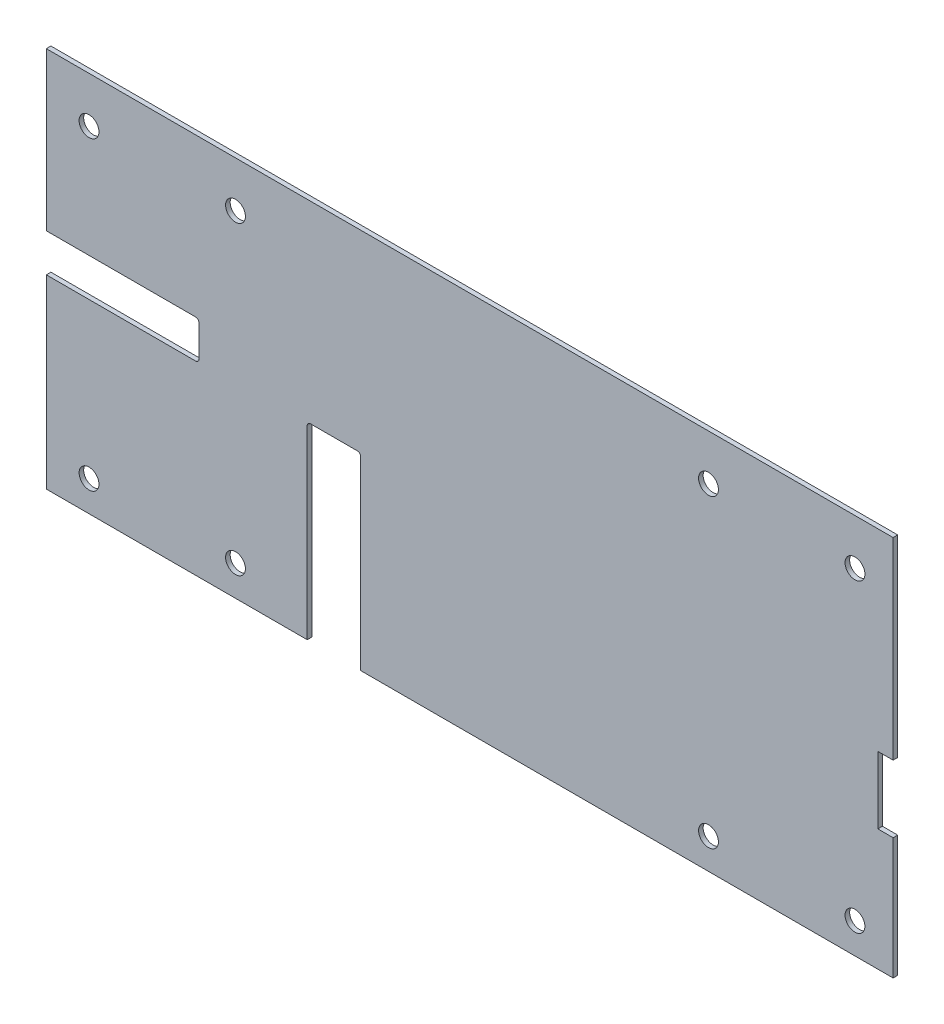
ISO-10303-21;
HEADER;
FILE_DESCRIPTION(('STEP AP214'),'2;1');
FILE_NAME('part.step','',(''),(''),'','','');
FILE_SCHEMA(('AUTOMOTIVE_DESIGN { 1 0 10303 214 1 1 1 1 }'));
ENDSEC;
DATA;
#1=APPLICATION_CONTEXT('core data for automotive mechanical design processes');
#2=APPLICATION_PROTOCOL_DEFINITION('international standard','automotive_design',2000,#1);
#3=PRODUCT_CONTEXT('',#1,'mechanical');
#4=PRODUCT('Part','Part','',(#3));
#5=PRODUCT_RELATED_PRODUCT_CATEGORY('part','',(#4));
#6=PRODUCT_DEFINITION_FORMATION('','',#4);
#7=PRODUCT_DEFINITION_CONTEXT('part definition',#1,'design');
#8=PRODUCT_DEFINITION('design','',#6,#7);
#9=PRODUCT_DEFINITION_SHAPE('','',#8);
#10=(LENGTH_UNIT() NAMED_UNIT(*) SI_UNIT(.MILLI.,.METRE.));
#11=(NAMED_UNIT(*) PLANE_ANGLE_UNIT() SI_UNIT($,.RADIAN.));
#12=(NAMED_UNIT(*) SI_UNIT($,.STERADIAN.) SOLID_ANGLE_UNIT());
#13=UNCERTAINTY_MEASURE_WITH_UNIT(LENGTH_MEASURE(1.E-05),#10,'distance_accuracy_value','');
#14=(GEOMETRIC_REPRESENTATION_CONTEXT(3) GLOBAL_UNCERTAINTY_ASSIGNED_CONTEXT((#13)) GLOBAL_UNIT_ASSIGNED_CONTEXT((#10,
#11,#12)) REPRESENTATION_CONTEXT('',''));
#15=CARTESIAN_POINT('',(0.,0.,0.));
#16=DIRECTION('',(0.,0.,1.));
#17=DIRECTION('',(1.,0.,0.));
#18=AXIS2_PLACEMENT_3D('',#15,#16,#17);
#19=CARTESIAN_POINT('',(-277.5,-125.,3.));
#20=DIRECTION('',(1.,0.,0.));
#21=DIRECTION('',(0.,0.,-1.));
#22=AXIS2_PLACEMENT_3D('',#19,#20,#21);
#23=PLANE('',#22);
#24=DIRECTION('',(0.,-1.,0.));
#25=VECTOR('',#24,1.);
#26=CARTESIAN_POINT('',(-277.5,-125.,0.));
#27=LINE('',#26,#25);
#28=CARTESIAN_POINT('',(-277.5,125.,0.));
#29=VERTEX_POINT('',#28);
#30=CARTESIAN_POINT('',(-277.5,21.6289621839158,0.));
#31=VERTEX_POINT('',#30);
#32=EDGE_CURVE('E218',#29,#31,#27,.T.);
#33=ORIENTED_EDGE('',*,*,#32,.T.);
#34=DIRECTION('',(0.,0.,1.));
#35=VECTOR('',#34,1.);
#36=CARTESIAN_POINT('',(-277.5,21.6289621839158,3.));
#37=LINE('',#36,#35);
#38=CARTESIAN_POINT('',(-277.5,21.6289621839158,3.));
#39=VERTEX_POINT('',#38);
#40=EDGE_CURVE('E179',#31,#39,#37,.T.);
#41=ORIENTED_EDGE('',*,*,#40,.T.);
#42=DIRECTION('',(0.,-1.,0.));
#43=VECTOR('',#42,1.);
#44=CARTESIAN_POINT('',(-277.5,-125.,3.));
#45=LINE('',#44,#43);
#46=CARTESIAN_POINT('',(-277.5,125.,3.));
#47=VERTEX_POINT('',#46);
#48=EDGE_CURVE('E198',#47,#39,#45,.T.);
#49=ORIENTED_EDGE('',*,*,#48,.F.);
#50=DIRECTION('',(0.,0.,-1.));
#51=VECTOR('',#50,1.);
#52=CARTESIAN_POINT('',(-277.5,125.,3.));
#53=LINE('',#52,#51);
#54=EDGE_CURVE('E217',#47,#29,#53,.T.);
#55=ORIENTED_EDGE('',*,*,#54,.T.);
#56=EDGE_LOOP('',(#33,#41,#49,#55));
#57=FACE_BOUND('',#56,.T.);
#58=ADVANCED_FACE('F33',(#57),#23,.F.);
#59=CARTESIAN_POINT('',(277.5,-125.,3.));
#60=DIRECTION('',(0.,1.,0.));
#61=DIRECTION('',(-1.,0.,0.));
#62=AXIS2_PLACEMENT_3D('',#59,#60,#61);
#63=PLANE('',#62);
#64=DIRECTION('',(1.,0.,0.));
#65=VECTOR('',#64,1.);
#66=CARTESIAN_POINT('',(277.5,-125.,3.));
#67=LINE('',#66,#65);
#68=CARTESIAN_POINT('',(-71.5,-125.,3.));
#69=VERTEX_POINT('',#68);
#70=CARTESIAN_POINT('',(277.5,-125.,3.));
#71=VERTEX_POINT('',#70);
#72=EDGE_CURVE('E202',#69,#71,#67,.T.);
#73=ORIENTED_EDGE('',*,*,#72,.F.);
#74=DIRECTION('',(0.,0.,-1.));
#75=VECTOR('',#74,1.);
#76=CARTESIAN_POINT('',(-71.5,-125.,3.));
#77=LINE('',#76,#75);
#78=CARTESIAN_POINT('',(-71.5,-125.,0.));
#79=VERTEX_POINT('',#78);
#80=EDGE_CURVE('E180',#69,#79,#77,.T.);
#81=ORIENTED_EDGE('',*,*,#80,.T.);
#82=DIRECTION('',(1.,0.,0.));
#83=VECTOR('',#82,1.);
#84=CARTESIAN_POINT('',(277.5,-125.,0.));
#85=LINE('',#84,#83);
#86=CARTESIAN_POINT('',(277.5,-125.,0.));
#87=VERTEX_POINT('',#86);
#88=EDGE_CURVE('E221',#79,#87,#85,.T.);
#89=ORIENTED_EDGE('',*,*,#88,.T.);
#90=DIRECTION('',(0.,0.,-1.));
#91=VECTOR('',#90,1.);
#92=CARTESIAN_POINT('',(277.5,-125.,3.));
#93=LINE('',#92,#91);
#94=EDGE_CURVE('E234',#71,#87,#93,.T.);
#95=ORIENTED_EDGE('',*,*,#94,.F.);
#96=EDGE_LOOP('',(#73,#81,#89,#95));
#97=FACE_BOUND('',#96,.T.);
#98=ADVANCED_FACE('F373',(#97),#63,.F.);
#99=CARTESIAN_POINT('',(277.5,-125.,3.));
#100=DIRECTION('',(-1.,0.,0.));
#101=DIRECTION('',(0.,0.,1.));
#102=AXIS2_PLACEMENT_3D('',#99,#100,#101);
#103=PLANE('',#102);
#104=DIRECTION('',(0.,1.,0.));
#105=VECTOR('',#104,1.);
#106=CARTESIAN_POINT('',(277.5,-125.,0.));
#107=LINE('',#106,#105);
#108=CARTESIAN_POINT('',(277.5,-45.3710378160842,0.));
#109=VERTEX_POINT('',#108);
#110=EDGE_CURVE('E203',#87,#109,#107,.T.);
#111=ORIENTED_EDGE('',*,*,#110,.T.);
#112=DIRECTION('',(0.,0.,1.));
#113=VECTOR('',#112,1.);
#114=CARTESIAN_POINT('',(277.5,-45.3710378160842,3.));
#115=LINE('',#114,#113);
#116=CARTESIAN_POINT('',(277.5,-45.3710378160842,3.));
#117=VERTEX_POINT('',#116);
#118=EDGE_CURVE('E241',#109,#117,#115,.T.);
#119=ORIENTED_EDGE('',*,*,#118,.T.);
#120=DIRECTION('',(0.,1.,0.));
#121=VECTOR('',#120,1.);
#122=CARTESIAN_POINT('',(277.5,-125.,3.));
#123=LINE('',#122,#121);
#124=EDGE_CURVE('E212',#71,#117,#123,.T.);
#125=ORIENTED_EDGE('',*,*,#124,.F.);
#126=ORIENTED_EDGE('',*,*,#94,.T.);
#127=EDGE_LOOP('',(#111,#119,#125,#126));
#128=FACE_BOUND('',#127,.T.);
#129=ADVANCED_FACE('F379',(#128),#103,.F.);
#130=CARTESIAN_POINT('',(0.,0.,3.));
#131=DIRECTION('',(0.,0.,1.));
#132=DIRECTION('',(1.,0.,0.));
#133=AXIS2_PLACEMENT_3D('',#130,#131,#132);
#134=PLANE('',#133);
#135=DIRECTION('',(-1.,0.,0.));
#136=VECTOR('',#135,1.);
#137=CARTESIAN_POINT('',(-277.5,21.6289621839158,3.));
#138=LINE('',#137,#136);
#139=CARTESIAN_POINT('',(-179.5,21.6289621839158,3.));
#140=VERTEX_POINT('',#139);
#141=EDGE_CURVE('E289',#140,#39,#138,.T.);
#142=ORIENTED_EDGE('',*,*,#141,.F.);
#143=CARTESIAN_POINT('',(-179.5,19.6289621839158,3.));
#144=DIRECTION('',(0.,0.,1.));
#145=DIRECTION('',(1.,0.,0.));
#146=AXIS2_PLACEMENT_3D('',#143,#144,#145);
#147=CIRCLE('',#146,2.);
#148=CARTESIAN_POINT('',(-177.5,19.6289621839158,3.));
#149=VERTEX_POINT('',#148);
#150=EDGE_CURVE('E41',#140,#149,#147,.F.);
#151=ORIENTED_EDGE('',*,*,#150,.T.);
#152=DIRECTION('',(0.,1.,0.));
#153=VECTOR('',#152,1.);
#154=CARTESIAN_POINT('',(-177.5,-3.37103781608424,3.));
#155=LINE('',#154,#153);
#156=CARTESIAN_POINT('',(-177.5,-1.37103781608423,3.));
#157=VERTEX_POINT('',#156);
#158=EDGE_CURVE('E191',#157,#149,#155,.T.);
#159=ORIENTED_EDGE('',*,*,#158,.F.);
#160=CARTESIAN_POINT('',(-179.5,-1.37103781608423,3.));
#161=DIRECTION('',(0.,0.,1.));
#162=DIRECTION('',(1.,0.,0.));
#163=AXIS2_PLACEMENT_3D('',#160,#161,#162);
#164=CIRCLE('',#163,2.);
#165=CARTESIAN_POINT('',(-179.5,-3.37103781608423,3.));
#166=VERTEX_POINT('',#165);
#167=EDGE_CURVE('E190',#157,#166,#164,.F.);
#168=ORIENTED_EDGE('',*,*,#167,.T.);
#169=DIRECTION('',(1.,0.,0.));
#170=VECTOR('',#169,1.);
#171=CARTESIAN_POINT('',(-277.5,-3.37103781608422,3.));
#172=LINE('',#171,#170);
#173=CARTESIAN_POINT('',(-277.5,-3.37103781608422,3.));
#174=VERTEX_POINT('',#173);
#175=EDGE_CURVE('E172',#174,#166,#172,.T.);
#176=ORIENTED_EDGE('',*,*,#175,.F.);
#177=CARTESIAN_POINT('',(-277.5,-125.,3.));
#178=VERTEX_POINT('',#177);
#179=EDGE_CURVE('E187',#174,#178,#45,.T.);
#180=ORIENTED_EDGE('',*,*,#179,.T.);
#181=CARTESIAN_POINT('',(-106.5,-125.,3.));
#182=VERTEX_POINT('',#181);
#183=EDGE_CURVE('E209',#178,#182,#67,.T.);
#184=ORIENTED_EDGE('',*,*,#183,.T.);
#185=DIRECTION('',(0.,-1.,0.));
#186=VECTOR('',#185,1.);
#187=CARTESIAN_POINT('',(-106.5,-1.37103781608425,3.));
#188=LINE('',#187,#186);
#189=CARTESIAN_POINT('',(-106.5,-3.37103781608425,3.));
#190=VERTEX_POINT('',#189);
#191=EDGE_CURVE('E192',#190,#182,#188,.T.);
#192=ORIENTED_EDGE('',*,*,#191,.F.);
#193=CARTESIAN_POINT('',(-104.5,-3.37103781608425,3.));
#194=DIRECTION('',(0.,0.,1.));
#195=DIRECTION('',(1.,0.,0.));
#196=AXIS2_PLACEMENT_3D('',#193,#194,#195);
#197=CIRCLE('',#196,2.);
#198=CARTESIAN_POINT('',(-104.5,-1.37103781608425,3.));
#199=VERTEX_POINT('',#198);
#200=EDGE_CURVE('E282',#190,#199,#197,.F.);
#201=ORIENTED_EDGE('',*,*,#200,.T.);
#202=DIRECTION('',(-1.,0.,0.));
#203=VECTOR('',#202,1.);
#204=CARTESIAN_POINT('',(-71.5,-1.37103781608424,3.));
#205=LINE('',#204,#203);
#206=CARTESIAN_POINT('',(-73.5,-1.37103781608424,3.));
#207=VERTEX_POINT('',#206);
#208=EDGE_CURVE('E431',#207,#199,#205,.T.);
#209=ORIENTED_EDGE('',*,*,#208,.F.);
#210=CARTESIAN_POINT('',(-73.5,-3.37103781608424,3.));
#211=DIRECTION('',(0.,0.,1.));
#212=DIRECTION('',(1.,0.,0.));
#213=AXIS2_PLACEMENT_3D('',#210,#211,#212);
#214=CIRCLE('',#213,2.);
#215=CARTESIAN_POINT('',(-71.5,-3.37103781608424,3.));
#216=VERTEX_POINT('',#215);
#217=EDGE_CURVE('E278',#207,#216,#214,.F.);
#218=ORIENTED_EDGE('',*,*,#217,.T.);
#219=DIRECTION('',(0.,1.,0.));
#220=VECTOR('',#219,1.);
#221=CARTESIAN_POINT('',(-71.5,-1.37103781608424,3.));
#222=LINE('',#221,#220);
#223=EDGE_CURVE('E436',#69,#216,#222,.T.);
#224=ORIENTED_EDGE('',*,*,#223,.F.);
#225=ORIENTED_EDGE('',*,*,#72,.T.);
#226=ORIENTED_EDGE('',*,*,#124,.T.);
#227=DIRECTION('',(1.,0.,0.));
#228=VECTOR('',#227,1.);
#229=CARTESIAN_POINT('',(277.5,-45.3710378160842,3.));
#230=LINE('',#229,#228);
#231=CARTESIAN_POINT('',(267.5,-45.3710378160842,3.));
#232=VERTEX_POINT('',#231);
#233=EDGE_CURVE('E449',#232,#117,#230,.T.);
#234=ORIENTED_EDGE('',*,*,#233,.F.);
#235=DIRECTION('',(0.,-1.,0.));
#236=VECTOR('',#235,1.);
#237=CARTESIAN_POINT('',(267.5,-1.3710378160842,3.));
#238=LINE('',#237,#236);
#239=CARTESIAN_POINT('',(267.5,-1.3710378160842,3.));
#240=VERTEX_POINT('',#239);
#241=EDGE_CURVE('E446',#240,#232,#238,.T.);
#242=ORIENTED_EDGE('',*,*,#241,.F.);
#243=DIRECTION('',(-1.,0.,0.));
#244=VECTOR('',#243,1.);
#245=CARTESIAN_POINT('',(277.5,-1.37103781608421,3.));
#246=LINE('',#245,#244);
#247=CARTESIAN_POINT('',(277.5,-1.37103781608421,3.));
#248=VERTEX_POINT('',#247);
#249=EDGE_CURVE('E443',#248,#240,#246,.T.);
#250=ORIENTED_EDGE('',*,*,#249,.F.);
#251=CARTESIAN_POINT('',(277.5,125.,3.));
#252=VERTEX_POINT('',#251);
#253=EDGE_CURVE('E211',#248,#252,#123,.T.);
#254=ORIENTED_EDGE('',*,*,#253,.T.);
#255=DIRECTION('',(-1.,0.,0.));
#256=VECTOR('',#255,1.);
#257=CARTESIAN_POINT('',(277.5,125.,3.));
#258=LINE('',#257,#256);
#259=EDGE_CURVE('E215',#252,#47,#258,.T.);
#260=ORIENTED_EDGE('',*,*,#259,.T.);
#261=ORIENTED_EDGE('',*,*,#48,.T.);
#262=EDGE_LOOP('',(#142,#151,#159,#168,#176,#180,#184,#192,#201,#209,#218,#224,#225,#226,#234,
#242,#250,#254,#260,#261));
#263=FACE_BOUND('',#262,.T.);
#264=CARTESIAN_POINT('',(-249.5,95.,3.));
#265=DIRECTION('',(0.,0.,1.));
#266=DIRECTION('',(1.,0.,0.));
#267=AXIS2_PLACEMENT_3D('',#264,#265,#266);
#268=CIRCLE('',#267,6.50000000000002);
#269=CARTESIAN_POINT('',(-243.,95.,3.));
#270=VERTEX_POINT('',#269);
#271=EDGE_CURVE('E312',#270,#270,#268,.T.);
#272=ORIENTED_EDGE('',*,*,#271,.F.);
#273=EDGE_LOOP('',(#272));
#274=FACE_BOUND('',#273,.T.);
#275=CARTESIAN_POINT('',(-153.5,-105.,3.));
#276=DIRECTION('',(0.,0.,1.));
#277=DIRECTION('',(1.,0.,0.));
#278=AXIS2_PLACEMENT_3D('',#275,#276,#277);
#279=CIRCLE('',#278,6.50000000000002);
#280=CARTESIAN_POINT('',(-147.,-105.,3.));
#281=VERTEX_POINT('',#280);
#282=EDGE_CURVE('E324',#281,#281,#279,.T.);
#283=ORIENTED_EDGE('',*,*,#282,.F.);
#284=EDGE_LOOP('',(#283));
#285=FACE_BOUND('',#284,.T.);
#286=CARTESIAN_POINT('',(156.5,-105.,3.));
#287=DIRECTION('',(0.,0.,1.));
#288=DIRECTION('',(1.,0.,0.));
#289=AXIS2_PLACEMENT_3D('',#286,#287,#288);
#290=CIRCLE('',#289,6.50000000000002);
#291=CARTESIAN_POINT('',(163.,-105.,3.));
#292=VERTEX_POINT('',#291);
#293=EDGE_CURVE('E336',#292,#292,#290,.T.);
#294=ORIENTED_EDGE('',*,*,#293,.F.);
#295=EDGE_LOOP('',(#294));
#296=FACE_BOUND('',#295,.T.);
#297=CARTESIAN_POINT('',(156.5,95.,3.));
#298=DIRECTION('',(0.,0.,1.));
#299=DIRECTION('',(1.,0.,0.));
#300=AXIS2_PLACEMENT_3D('',#297,#298,#299);
#301=CIRCLE('',#300,6.50000000000002);
#302=CARTESIAN_POINT('',(163.,95.,3.));
#303=VERTEX_POINT('',#302);
#304=EDGE_CURVE('E346',#303,#303,#301,.T.);
#305=ORIENTED_EDGE('',*,*,#304,.F.);
#306=EDGE_LOOP('',(#305));
#307=FACE_BOUND('',#306,.T.);
#308=CARTESIAN_POINT('',(252.5,95.,3.));
#309=DIRECTION('',(0.,0.,1.));
#310=DIRECTION('',(1.,0.,0.));
#311=AXIS2_PLACEMENT_3D('',#308,#309,#310);
#312=CIRCLE('',#311,6.50000000000002);
#313=CARTESIAN_POINT('',(259.,95.,3.));
#314=VERTEX_POINT('',#313);
#315=EDGE_CURVE('E342',#314,#314,#312,.T.);
#316=ORIENTED_EDGE('',*,*,#315,.F.);
#317=EDGE_LOOP('',(#316));
#318=FACE_BOUND('',#317,.T.);
#319=CARTESIAN_POINT('',(252.5,-105.,3.));
#320=DIRECTION('',(0.,0.,1.));
#321=DIRECTION('',(1.,0.,0.));
#322=AXIS2_PLACEMENT_3D('',#319,#320,#321);
#323=CIRCLE('',#322,6.50000000000007);
#324=CARTESIAN_POINT('',(259.,-105.,3.));
#325=VERTEX_POINT('',#324);
#326=EDGE_CURVE('E330',#325,#325,#323,.T.);
#327=ORIENTED_EDGE('',*,*,#326,.F.);
#328=EDGE_LOOP('',(#327));
#329=FACE_BOUND('',#328,.T.);
#330=CARTESIAN_POINT('',(-153.5,95.,3.));
#331=DIRECTION('',(0.,0.,1.));
#332=DIRECTION('',(1.,0.,0.));
#333=AXIS2_PLACEMENT_3D('',#330,#331,#332);
#334=CIRCLE('',#333,6.50000000000002);
#335=CARTESIAN_POINT('',(-147.,95.,3.));
#336=VERTEX_POINT('',#335);
#337=EDGE_CURVE('E318',#336,#336,#334,.T.);
#338=ORIENTED_EDGE('',*,*,#337,.F.);
#339=EDGE_LOOP('',(#338));
#340=FACE_BOUND('',#339,.T.);
#341=CARTESIAN_POINT('',(-249.5,-105.,3.));
#342=DIRECTION('',(0.,0.,1.));
#343=DIRECTION('',(1.,0.,0.));
#344=AXIS2_PLACEMENT_3D('',#341,#342,#343);
#345=CIRCLE('',#344,6.50000000000002);
#346=CARTESIAN_POINT('',(-243.,-105.,3.));
#347=VERTEX_POINT('',#346);
#348=EDGE_CURVE('E303',#347,#347,#345,.T.);
#349=ORIENTED_EDGE('',*,*,#348,.F.);
#350=EDGE_LOOP('',(#349));
#351=FACE_BOUND('',#350,.T.);
#352=ADVANCED_FACE('F184',(#263,#274,#285,#296,#307,#318,#329,#340,#351),#134,.T.);
#353=CARTESIAN_POINT('',(0.,0.,0.));
#354=DIRECTION('',(0.,0.,1.));
#355=DIRECTION('',(1.,0.,0.));
#356=AXIS2_PLACEMENT_3D('',#353,#354,#355);
#357=PLANE('',#356);
#358=DIRECTION('',(1.,0.,0.));
#359=VECTOR('',#358,1.);
#360=CARTESIAN_POINT('',(0.,-3.37103781608426,0.));
#361=LINE('',#360,#359);
#362=CARTESIAN_POINT('',(-277.5,-3.37103781608422,0.));
#363=VERTEX_POINT('',#362);
#364=CARTESIAN_POINT('',(-179.5,-3.37103781608424,0.));
#365=VERTEX_POINT('',#364);
#366=EDGE_CURVE('E175',#363,#365,#361,.T.);
#367=ORIENTED_EDGE('',*,*,#366,.T.);
#368=CARTESIAN_POINT('',(-179.5,-1.37103781608423,0.));
#369=DIRECTION('',(0.,0.,1.));
#370=DIRECTION('',(1.,0.,0.));
#371=AXIS2_PLACEMENT_3D('',#368,#369,#370);
#372=CIRCLE('',#371,2.);
#373=CARTESIAN_POINT('',(-177.5,-1.37103781608423,0.));
#374=VERTEX_POINT('',#373);
#375=EDGE_CURVE('E287',#365,#374,#372,.T.);
#376=ORIENTED_EDGE('',*,*,#375,.T.);
#377=DIRECTION('',(0.,1.,0.));
#378=VECTOR('',#377,1.);
#379=CARTESIAN_POINT('',(-177.5,0.,0.));
#380=LINE('',#379,#378);
#381=CARTESIAN_POINT('',(-177.5,19.6289621839158,0.));
#382=VERTEX_POINT('',#381);
#383=EDGE_CURVE('E257',#374,#382,#380,.T.);
#384=ORIENTED_EDGE('',*,*,#383,.T.);
#385=CARTESIAN_POINT('',(-179.5,19.6289621839158,0.));
#386=DIRECTION('',(0.,0.,1.));
#387=DIRECTION('',(1.,0.,0.));
#388=AXIS2_PLACEMENT_3D('',#385,#386,#387);
#389=CIRCLE('',#388,2.);
#390=CARTESIAN_POINT('',(-179.5,21.6289621839158,0.));
#391=VERTEX_POINT('',#390);
#392=EDGE_CURVE('E11',#382,#391,#389,.T.);
#393=ORIENTED_EDGE('',*,*,#392,.T.);
#394=DIRECTION('',(-1.,0.,0.));
#395=VECTOR('',#394,1.);
#396=CARTESIAN_POINT('',(0.,21.6289621839158,0.));
#397=LINE('',#396,#395);
#398=EDGE_CURVE('E298',#391,#31,#397,.T.);
#399=ORIENTED_EDGE('',*,*,#398,.T.);
#400=ORIENTED_EDGE('',*,*,#32,.F.);
#401=DIRECTION('',(-1.,0.,0.));
#402=VECTOR('',#401,1.);
#403=CARTESIAN_POINT('',(277.5,125.,0.));
#404=LINE('',#403,#402);
#405=CARTESIAN_POINT('',(277.5,125.,0.));
#406=VERTEX_POINT('',#405);
#407=EDGE_CURVE('E199',#406,#29,#404,.T.);
#408=ORIENTED_EDGE('',*,*,#407,.F.);
#409=CARTESIAN_POINT('',(277.5,-1.37103781608421,0.));
#410=VERTEX_POINT('',#409);
#411=EDGE_CURVE('E226',#410,#406,#107,.T.);
#412=ORIENTED_EDGE('',*,*,#411,.F.);
#413=DIRECTION('',(-1.,0.,0.));
#414=VECTOR('',#413,1.);
#415=CARTESIAN_POINT('',(0.,-1.37103781608401,0.));
#416=LINE('',#415,#414);
#417=CARTESIAN_POINT('',(267.5,-1.3710378160842,0.));
#418=VERTEX_POINT('',#417);
#419=EDGE_CURVE('E415',#410,#418,#416,.T.);
#420=ORIENTED_EDGE('',*,*,#419,.T.);
#421=DIRECTION('',(0.,-1.,0.));
#422=VECTOR('',#421,1.);
#423=CARTESIAN_POINT('',(267.5,0.,0.));
#424=LINE('',#423,#422);
#425=CARTESIAN_POINT('',(267.5,-45.3710378160842,0.));
#426=VERTEX_POINT('',#425);
#427=EDGE_CURVE('E251',#418,#426,#424,.T.);
#428=ORIENTED_EDGE('',*,*,#427,.T.);
#429=DIRECTION('',(1.,0.,0.));
#430=VECTOR('',#429,1.);
#431=CARTESIAN_POINT('',(0.,-45.371037816084,0.));
#432=LINE('',#431,#430);
#433=EDGE_CURVE('E410',#426,#109,#432,.T.);
#434=ORIENTED_EDGE('',*,*,#433,.T.);
#435=ORIENTED_EDGE('',*,*,#110,.F.);
#436=ORIENTED_EDGE('',*,*,#88,.F.);
#437=DIRECTION('',(0.,1.,0.));
#438=VECTOR('',#437,1.);
#439=CARTESIAN_POINT('',(-71.5,0.,0.));
#440=LINE('',#439,#438);
#441=CARTESIAN_POINT('',(-71.5,-3.37103781608424,0.));
#442=VERTEX_POINT('',#441);
#443=EDGE_CURVE('E305',#79,#442,#440,.T.);
#444=ORIENTED_EDGE('',*,*,#443,.T.);
#445=CARTESIAN_POINT('',(-73.5,-3.37103781608424,0.));
#446=DIRECTION('',(0.,0.,1.));
#447=DIRECTION('',(1.,0.,0.));
#448=AXIS2_PLACEMENT_3D('',#445,#446,#447);
#449=CIRCLE('',#448,2.);
#450=CARTESIAN_POINT('',(-73.5,-1.37103781608424,0.));
#451=VERTEX_POINT('',#450);
#452=EDGE_CURVE('E280',#442,#451,#449,.T.);
#453=ORIENTED_EDGE('',*,*,#452,.T.);
#454=DIRECTION('',(-1.,0.,0.));
#455=VECTOR('',#454,1.);
#456=CARTESIAN_POINT('',(0.,-1.37103781608423,0.));
#457=LINE('',#456,#455);
#458=CARTESIAN_POINT('',(-104.5,-1.37103781608425,0.));
#459=VERTEX_POINT('',#458);
#460=EDGE_CURVE('E254',#451,#459,#457,.T.);
#461=ORIENTED_EDGE('',*,*,#460,.T.);
#462=CARTESIAN_POINT('',(-104.5,-3.37103781608425,0.));
#463=DIRECTION('',(0.,0.,1.));
#464=DIRECTION('',(1.,0.,0.));
#465=AXIS2_PLACEMENT_3D('',#462,#463,#464);
#466=CIRCLE('',#465,2.);
#467=CARTESIAN_POINT('',(-106.5,-3.37103781608425,0.));
#468=VERTEX_POINT('',#467);
#469=EDGE_CURVE('E284',#459,#468,#466,.T.);
#470=ORIENTED_EDGE('',*,*,#469,.T.);
#471=DIRECTION('',(0.,-1.,0.));
#472=VECTOR('',#471,1.);
#473=CARTESIAN_POINT('',(-106.5,0.,0.));
#474=LINE('',#473,#472);
#475=CARTESIAN_POINT('',(-106.5,-125.,0.));
#476=VERTEX_POINT('',#475);
#477=EDGE_CURVE('E414',#468,#476,#474,.T.);
#478=ORIENTED_EDGE('',*,*,#477,.T.);
#479=CARTESIAN_POINT('',(-277.5,-125.,0.));
#480=VERTEX_POINT('',#479);
#481=EDGE_CURVE('E223',#480,#476,#85,.T.);
#482=ORIENTED_EDGE('',*,*,#481,.F.);
#483=EDGE_CURVE('E222',#363,#480,#27,.T.);
#484=ORIENTED_EDGE('',*,*,#483,.F.);
#485=EDGE_LOOP('',(#367,#376,#384,#393,#399,#400,#408,#412,#420,#428,#434,#435,#436,#444,#453,
#461,#470,#478,#482,#484));
#486=FACE_BOUND('',#485,.T.);
#487=CARTESIAN_POINT('',(156.5,95.,0.));
#488=DIRECTION('',(0.,0.,1.));
#489=DIRECTION('',(1.,0.,0.));
#490=AXIS2_PLACEMENT_3D('',#487,#488,#489);
#491=CIRCLE('',#490,6.50000000000002);
#492=CARTESIAN_POINT('',(163.,95.,0.));
#493=VERTEX_POINT('',#492);
#494=EDGE_CURVE('E207',#493,#493,#491,.T.);
#495=ORIENTED_EDGE('',*,*,#494,.T.);
#496=EDGE_LOOP('',(#495));
#497=FACE_BOUND('',#496,.T.);
#498=CARTESIAN_POINT('',(252.5,95.,0.));
#499=DIRECTION('',(0.,0.,1.));
#500=DIRECTION('',(1.,0.,0.));
#501=AXIS2_PLACEMENT_3D('',#498,#499,#500);
#502=CIRCLE('',#501,6.50000000000002);
#503=CARTESIAN_POINT('',(259.,95.,0.));
#504=VERTEX_POINT('',#503);
#505=EDGE_CURVE('E339',#504,#504,#502,.T.);
#506=ORIENTED_EDGE('',*,*,#505,.T.);
#507=EDGE_LOOP('',(#506));
#508=FACE_BOUND('',#507,.T.);
#509=CARTESIAN_POINT('',(156.5,-105.,0.));
#510=DIRECTION('',(0.,0.,1.));
#511=DIRECTION('',(1.,0.,0.));
#512=AXIS2_PLACEMENT_3D('',#509,#510,#511);
#513=CIRCLE('',#512,6.50000000000002);
#514=CARTESIAN_POINT('',(163.,-105.,0.));
#515=VERTEX_POINT('',#514);
#516=EDGE_CURVE('E333',#515,#515,#513,.T.);
#517=ORIENTED_EDGE('',*,*,#516,.T.);
#518=EDGE_LOOP('',(#517));
#519=FACE_BOUND('',#518,.T.);
#520=CARTESIAN_POINT('',(252.5,-105.,0.));
#521=DIRECTION('',(0.,0.,1.));
#522=DIRECTION('',(1.,0.,0.));
#523=AXIS2_PLACEMENT_3D('',#520,#521,#522);
#524=CIRCLE('',#523,6.50000000000007);
#525=CARTESIAN_POINT('',(259.,-105.,0.));
#526=VERTEX_POINT('',#525);
#527=EDGE_CURVE('E327',#526,#526,#524,.T.);
#528=ORIENTED_EDGE('',*,*,#527,.T.);
#529=EDGE_LOOP('',(#528));
#530=FACE_BOUND('',#529,.T.);
#531=CARTESIAN_POINT('',(-153.5,-105.,0.));
#532=DIRECTION('',(0.,0.,1.));
#533=DIRECTION('',(1.,0.,0.));
#534=AXIS2_PLACEMENT_3D('',#531,#532,#533);
#535=CIRCLE('',#534,6.50000000000002);
#536=CARTESIAN_POINT('',(-147.,-105.,0.));
#537=VERTEX_POINT('',#536);
#538=EDGE_CURVE('E321',#537,#537,#535,.T.);
#539=ORIENTED_EDGE('',*,*,#538,.T.);
#540=EDGE_LOOP('',(#539));
#541=FACE_BOUND('',#540,.T.);
#542=CARTESIAN_POINT('',(-153.5,95.,0.));
#543=DIRECTION('',(0.,0.,1.));
#544=DIRECTION('',(1.,0.,0.));
#545=AXIS2_PLACEMENT_3D('',#542,#543,#544);
#546=CIRCLE('',#545,6.50000000000002);
#547=CARTESIAN_POINT('',(-147.,95.,0.));
#548=VERTEX_POINT('',#547);
#549=EDGE_CURVE('E315',#548,#548,#546,.T.);
#550=ORIENTED_EDGE('',*,*,#549,.T.);
#551=EDGE_LOOP('',(#550));
#552=FACE_BOUND('',#551,.T.);
#553=CARTESIAN_POINT('',(-249.5,95.,0.));
#554=DIRECTION('',(0.,0.,1.));
#555=DIRECTION('',(1.,0.,0.));
#556=AXIS2_PLACEMENT_3D('',#553,#554,#555);
#557=CIRCLE('',#556,6.50000000000002);
#558=CARTESIAN_POINT('',(-243.,95.,0.));
#559=VERTEX_POINT('',#558);
#560=EDGE_CURVE('E310',#559,#559,#557,.T.);
#561=ORIENTED_EDGE('',*,*,#560,.T.);
#562=EDGE_LOOP('',(#561));
#563=FACE_BOUND('',#562,.T.);
#564=CARTESIAN_POINT('',(-249.5,-105.,0.));
#565=DIRECTION('',(0.,0.,1.));
#566=DIRECTION('',(1.,0.,0.));
#567=AXIS2_PLACEMENT_3D('',#564,#565,#566);
#568=CIRCLE('',#567,6.50000000000002);
#569=CARTESIAN_POINT('',(-243.,-105.,0.));
#570=VERTEX_POINT('',#569);
#571=EDGE_CURVE('E300',#570,#570,#568,.T.);
#572=ORIENTED_EDGE('',*,*,#571,.T.);
#573=EDGE_LOOP('',(#572));
#574=FACE_BOUND('',#573,.T.);
#575=ADVANCED_FACE('F353',(#486,#497,#508,#519,#530,#541,#552,#563,#574),#357,.F.);
#576=ORIENTED_EDGE('',*,*,#179,.F.);
#577=DIRECTION('',(0.,0.,-1.));
#578=VECTOR('',#577,1.);
#579=CARTESIAN_POINT('',(-277.5,-3.37103781608422,3.));
#580=LINE('',#579,#578);
#581=EDGE_CURVE('E169',#174,#363,#580,.T.);
#582=ORIENTED_EDGE('',*,*,#581,.T.);
#583=ORIENTED_EDGE('',*,*,#483,.T.);
#584=DIRECTION('',(0.,0.,-1.));
#585=VECTOR('',#584,1.);
#586=CARTESIAN_POINT('',(-277.5,-125.,3.));
#587=LINE('',#586,#585);
#588=EDGE_CURVE('E197',#178,#480,#587,.T.);
#589=ORIENTED_EDGE('',*,*,#588,.F.);
#590=EDGE_LOOP('',(#576,#582,#583,#589));
#591=FACE_BOUND('',#590,.T.);
#592=ADVANCED_FACE('F195',(#591),#23,.F.);
#593=ORIENTED_EDGE('',*,*,#481,.T.);
#594=DIRECTION('',(0.,0.,1.));
#595=VECTOR('',#594,1.);
#596=CARTESIAN_POINT('',(-106.5,-125.,3.));
#597=LINE('',#596,#595);
#598=EDGE_CURVE('E244',#476,#182,#597,.T.);
#599=ORIENTED_EDGE('',*,*,#598,.T.);
#600=ORIENTED_EDGE('',*,*,#183,.F.);
#601=ORIENTED_EDGE('',*,*,#588,.T.);
#602=EDGE_LOOP('',(#593,#599,#600,#601));
#603=FACE_BOUND('',#602,.T.);
#604=ADVANCED_FACE('F382',(#603),#63,.F.);
#605=ORIENTED_EDGE('',*,*,#253,.F.);
#606=DIRECTION('',(0.,0.,-1.));
#607=VECTOR('',#606,1.);
#608=CARTESIAN_POINT('',(277.5,-1.37103781608421,3.));
#609=LINE('',#608,#607);
#610=EDGE_CURVE('E238',#248,#410,#609,.T.);
#611=ORIENTED_EDGE('',*,*,#610,.T.);
#612=ORIENTED_EDGE('',*,*,#411,.T.);
#613=DIRECTION('',(0.,0.,-1.));
#614=VECTOR('',#613,1.);
#615=CARTESIAN_POINT('',(277.5,125.,3.));
#616=LINE('',#615,#614);
#617=EDGE_CURVE('E231',#252,#406,#616,.T.);
#618=ORIENTED_EDGE('',*,*,#617,.F.);
#619=EDGE_LOOP('',(#605,#611,#612,#618));
#620=FACE_BOUND('',#619,.T.);
#621=ADVANCED_FACE('F368',(#620),#103,.F.);
#622=CARTESIAN_POINT('',(277.5,125.,3.));
#623=DIRECTION('',(0.,-1.,0.));
#624=DIRECTION('',(0.,0.,-1.));
#625=AXIS2_PLACEMENT_3D('',#622,#623,#624);
#626=PLANE('',#625);
#627=ORIENTED_EDGE('',*,*,#407,.T.);
#628=ORIENTED_EDGE('',*,*,#54,.F.);
#629=ORIENTED_EDGE('',*,*,#259,.F.);
#630=ORIENTED_EDGE('',*,*,#617,.T.);
#631=EDGE_LOOP('',(#627,#628,#629,#630));
#632=FACE_BOUND('',#631,.T.);
#633=ADVANCED_FACE('F359',(#632),#626,.F.);
#634=CARTESIAN_POINT('',(156.5,95.,3.));
#635=DIRECTION('',(0.,0.,-1.));
#636=DIRECTION('',(-1.,0.,0.));
#637=AXIS2_PLACEMENT_3D('',#634,#635,#636);
#638=CYLINDRICAL_SURFACE('',#637,6.50000000000002);
#639=ORIENTED_EDGE('',*,*,#304,.T.);
#640=EDGE_LOOP('',(#639));
#641=FACE_BOUND('',#640,.T.);
#642=ORIENTED_EDGE('',*,*,#494,.F.);
#643=EDGE_LOOP('',(#642));
#644=FACE_BOUND('',#643,.T.);
#645=ADVANCED_FACE('F356',(#641,#644),#638,.F.);
#646=CARTESIAN_POINT('',(252.5,95.,3.));
#647=DIRECTION('',(0.,0.,-1.));
#648=DIRECTION('',(-1.,0.,0.));
#649=AXIS2_PLACEMENT_3D('',#646,#647,#648);
#650=CYLINDRICAL_SURFACE('',#649,6.50000000000002);
#651=ORIENTED_EDGE('',*,*,#315,.T.);
#652=EDGE_LOOP('',(#651));
#653=FACE_BOUND('',#652,.T.);
#654=ORIENTED_EDGE('',*,*,#505,.F.);
#655=EDGE_LOOP('',(#654));
#656=FACE_BOUND('',#655,.T.);
#657=ADVANCED_FACE('F358',(#653,#656),#650,.F.);
#658=CARTESIAN_POINT('',(156.5,-105.,3.));
#659=DIRECTION('',(0.,0.,-1.));
#660=DIRECTION('',(-1.,0.,0.));
#661=AXIS2_PLACEMENT_3D('',#658,#659,#660);
#662=CYLINDRICAL_SURFACE('',#661,6.50000000000002);
#663=ORIENTED_EDGE('',*,*,#293,.T.);
#664=EDGE_LOOP('',(#663));
#665=FACE_BOUND('',#664,.T.);
#666=ORIENTED_EDGE('',*,*,#516,.F.);
#667=EDGE_LOOP('',(#666));
#668=FACE_BOUND('',#667,.T.);
#669=ADVANCED_FACE('F365',(#665,#668),#662,.F.);
#670=CARTESIAN_POINT('',(252.5,-105.,3.));
#671=DIRECTION('',(0.,0.,-1.));
#672=DIRECTION('',(-1.,0.,0.));
#673=AXIS2_PLACEMENT_3D('',#670,#671,#672);
#674=CYLINDRICAL_SURFACE('',#673,6.50000000000007);
#675=ORIENTED_EDGE('',*,*,#326,.T.);
#676=EDGE_LOOP('',(#675));
#677=FACE_BOUND('',#676,.T.);
#678=ORIENTED_EDGE('',*,*,#527,.F.);
#679=EDGE_LOOP('',(#678));
#680=FACE_BOUND('',#679,.T.);
#681=ADVANCED_FACE('F488',(#677,#680),#674,.F.);
#682=CARTESIAN_POINT('',(-153.5,-105.,3.));
#683=DIRECTION('',(0.,0.,-1.));
#684=DIRECTION('',(-1.,0.,0.));
#685=AXIS2_PLACEMENT_3D('',#682,#683,#684);
#686=CYLINDRICAL_SURFACE('',#685,6.50000000000002);
#687=ORIENTED_EDGE('',*,*,#282,.T.);
#688=EDGE_LOOP('',(#687));
#689=FACE_BOUND('',#688,.T.);
#690=ORIENTED_EDGE('',*,*,#538,.F.);
#691=EDGE_LOOP('',(#690));
#692=FACE_BOUND('',#691,.T.);
#693=ADVANCED_FACE('F484',(#689,#692),#686,.F.);
#694=CARTESIAN_POINT('',(-153.5,95.,3.));
#695=DIRECTION('',(0.,0.,-1.));
#696=DIRECTION('',(-1.,0.,0.));
#697=AXIS2_PLACEMENT_3D('',#694,#695,#696);
#698=CYLINDRICAL_SURFACE('',#697,6.50000000000002);
#699=ORIENTED_EDGE('',*,*,#337,.T.);
#700=EDGE_LOOP('',(#699));
#701=FACE_BOUND('',#700,.T.);
#702=ORIENTED_EDGE('',*,*,#549,.F.);
#703=EDGE_LOOP('',(#702));
#704=FACE_BOUND('',#703,.T.);
#705=ADVANCED_FACE('F480',(#701,#704),#698,.F.);
#706=CARTESIAN_POINT('',(-249.5,95.,3.));
#707=DIRECTION('',(0.,0.,-1.));
#708=DIRECTION('',(-1.,0.,0.));
#709=AXIS2_PLACEMENT_3D('',#706,#707,#708);
#710=CYLINDRICAL_SURFACE('',#709,6.50000000000002);
#711=ORIENTED_EDGE('',*,*,#271,.T.);
#712=EDGE_LOOP('',(#711));
#713=FACE_BOUND('',#712,.T.);
#714=ORIENTED_EDGE('',*,*,#560,.F.);
#715=EDGE_LOOP('',(#714));
#716=FACE_BOUND('',#715,.T.);
#717=ADVANCED_FACE('F476',(#713,#716),#710,.F.);
#718=CARTESIAN_POINT('',(-249.5,-105.,3.));
#719=DIRECTION('',(0.,0.,-1.));
#720=DIRECTION('',(-1.,0.,0.));
#721=AXIS2_PLACEMENT_3D('',#718,#719,#720);
#722=CYLINDRICAL_SURFACE('',#721,6.50000000000002);
#723=ORIENTED_EDGE('',*,*,#348,.T.);
#724=EDGE_LOOP('',(#723));
#725=FACE_BOUND('',#724,.T.);
#726=ORIENTED_EDGE('',*,*,#571,.F.);
#727=EDGE_LOOP('',(#726));
#728=FACE_BOUND('',#727,.T.);
#729=ADVANCED_FACE('F468',(#725,#728),#722,.F.);
#730=CARTESIAN_POINT('',(267.5,-1.3710378160842,-7.));
#731=DIRECTION('',(-1.,0.,0.));
#732=DIRECTION('',(0.,0.,1.));
#733=AXIS2_PLACEMENT_3D('',#730,#731,#732);
#734=PLANE('',#733);
#735=DIRECTION('',(0.,0.,1.));
#736=VECTOR('',#735,1.);
#737=CARTESIAN_POINT('',(267.5,-1.3710378160842,-7.));
#738=LINE('',#737,#736);
#739=EDGE_CURVE('E451',#418,#240,#738,.T.);
#740=ORIENTED_EDGE('',*,*,#739,.T.);
#741=ORIENTED_EDGE('',*,*,#241,.T.);
#742=DIRECTION('',(0.,0.,1.));
#743=VECTOR('',#742,1.);
#744=CARTESIAN_POINT('',(267.5,-45.3710378160842,-7.));
#745=LINE('',#744,#743);
#746=EDGE_CURVE('E439',#426,#232,#745,.T.);
#747=ORIENTED_EDGE('',*,*,#746,.F.);
#748=ORIENTED_EDGE('',*,*,#427,.F.);
#749=EDGE_LOOP('',(#740,#741,#747,#748));
#750=FACE_BOUND('',#749,.T.);
#751=ADVANCED_FACE('F454',(#750),#734,.F.);
#752=CARTESIAN_POINT('',(277.5,-45.3710378160842,-7.));
#753=DIRECTION('',(0.,-1.,0.));
#754=DIRECTION('',(1.,0.,0.));
#755=AXIS2_PLACEMENT_3D('',#752,#753,#754);
#756=PLANE('',#755);
#757=ORIENTED_EDGE('',*,*,#746,.T.);
#758=ORIENTED_EDGE('',*,*,#233,.T.);
#759=ORIENTED_EDGE('',*,*,#118,.F.);
#760=ORIENTED_EDGE('',*,*,#433,.F.);
#761=EDGE_LOOP('',(#757,#758,#759,#760));
#762=FACE_BOUND('',#761,.T.);
#763=ADVANCED_FACE('F460',(#762),#756,.F.);
#764=CARTESIAN_POINT('',(277.5,-1.37103781608421,-7.));
#765=DIRECTION('',(0.,1.,0.));
#766=DIRECTION('',(-1.,0.,0.));
#767=AXIS2_PLACEMENT_3D('',#764,#765,#766);
#768=PLANE('',#767);
#769=ORIENTED_EDGE('',*,*,#610,.F.);
#770=ORIENTED_EDGE('',*,*,#249,.T.);
#771=ORIENTED_EDGE('',*,*,#739,.F.);
#772=ORIENTED_EDGE('',*,*,#419,.F.);
#773=EDGE_LOOP('',(#769,#770,#771,#772));
#774=FACE_BOUND('',#773,.T.);
#775=ADVANCED_FACE('F459',(#774),#768,.F.);
#776=CARTESIAN_POINT('',(-71.5,-1.37103781608424,-7.));
#777=DIRECTION('',(0.,1.,0.));
#778=DIRECTION('',(-1.,0.,0.));
#779=AXIS2_PLACEMENT_3D('',#776,#777,#778);
#780=PLANE('',#779);
#781=ORIENTED_EDGE('',*,*,#460,.F.);
#782=DIRECTION('',(0.,0.,1.));
#783=VECTOR('',#782,1.);
#784=CARTESIAN_POINT('',(-73.5,-1.37103781608424,3.));
#785=LINE('',#784,#783);
#786=EDGE_CURVE('E261',#451,#207,#785,.T.);
#787=ORIENTED_EDGE('',*,*,#786,.T.);
#788=ORIENTED_EDGE('',*,*,#208,.T.);
#789=DIRECTION('',(0.,0.,1.));
#790=VECTOR('',#789,1.);
#791=CARTESIAN_POINT('',(-104.5,-1.37103781608425,0.));
#792=LINE('',#791,#790);
#793=EDGE_CURVE('E259',#199,#459,#792,.F.);
#794=ORIENTED_EDGE('',*,*,#793,.T.);
#795=EDGE_LOOP('',(#781,#787,#788,#794));
#796=FACE_BOUND('',#795,.T.);
#797=ADVANCED_FACE('F430',(#796),#780,.F.);
#798=CARTESIAN_POINT('',(-71.5,-1.37103781608424,-7.));
#799=DIRECTION('',(1.,0.,0.));
#800=DIRECTION('',(0.,0.,-1.));
#801=AXIS2_PLACEMENT_3D('',#798,#799,#800);
#802=PLANE('',#801);
#803=ORIENTED_EDGE('',*,*,#223,.T.);
#804=DIRECTION('',(0.,0.,1.));
#805=VECTOR('',#804,1.);
#806=CARTESIAN_POINT('',(-71.5,-3.37103781608424,0.));
#807=LINE('',#806,#805);
#808=EDGE_CURVE('E264',#216,#442,#807,.F.);
#809=ORIENTED_EDGE('',*,*,#808,.T.);
#810=ORIENTED_EDGE('',*,*,#443,.F.);
#811=ORIENTED_EDGE('',*,*,#80,.F.);
#812=EDGE_LOOP('',(#803,#809,#810,#811));
#813=FACE_BOUND('',#812,.T.);
#814=ADVANCED_FACE('F471',(#813),#802,.F.);
#815=CARTESIAN_POINT('',(-106.5,-1.37103781608425,-7.));
#816=DIRECTION('',(-1.,0.,0.));
#817=DIRECTION('',(0.,-1.,0.));
#818=AXIS2_PLACEMENT_3D('',#815,#816,#817);
#819=PLANE('',#818);
#820=ORIENTED_EDGE('',*,*,#477,.F.);
#821=DIRECTION('',(0.,0.,1.));
#822=VECTOR('',#821,1.);
#823=CARTESIAN_POINT('',(-106.5,-3.37103781608425,3.));
#824=LINE('',#823,#822);
#825=EDGE_CURVE('E266',#468,#190,#824,.T.);
#826=ORIENTED_EDGE('',*,*,#825,.T.);
#827=ORIENTED_EDGE('',*,*,#191,.T.);
#828=ORIENTED_EDGE('',*,*,#598,.F.);
#829=EDGE_LOOP('',(#820,#826,#827,#828));
#830=FACE_BOUND('',#829,.T.);
#831=ADVANCED_FACE('F595',(#830),#819,.F.);
#832=CARTESIAN_POINT('',(-177.5,-3.37103781608424,-7.));
#833=DIRECTION('',(1.,0.,0.));
#834=DIRECTION('',(0.,0.,-1.));
#835=AXIS2_PLACEMENT_3D('',#832,#833,#834);
#836=PLANE('',#835);
#837=ORIENTED_EDGE('',*,*,#383,.F.);
#838=DIRECTION('',(0.,0.,1.));
#839=VECTOR('',#838,1.);
#840=CARTESIAN_POINT('',(-177.5,-1.37103781608423,3.));
#841=LINE('',#840,#839);
#842=EDGE_CURVE('E271',#374,#157,#841,.T.);
#843=ORIENTED_EDGE('',*,*,#842,.T.);
#844=ORIENTED_EDGE('',*,*,#158,.T.);
#845=DIRECTION('',(0.,0.,1.));
#846=VECTOR('',#845,1.);
#847=CARTESIAN_POINT('',(-177.5,19.6289621839158,0.));
#848=LINE('',#847,#846);
#849=EDGE_CURVE('E269',#149,#382,#848,.F.);
#850=ORIENTED_EDGE('',*,*,#849,.T.);
#851=EDGE_LOOP('',(#837,#843,#844,#850));
#852=FACE_BOUND('',#851,.T.);
#853=ADVANCED_FACE('F292',(#852),#836,.F.);
#854=CARTESIAN_POINT('',(-277.5,21.6289621839158,-7.));
#855=DIRECTION('',(0.,1.,0.));
#856=DIRECTION('',(0.,0.,1.));
#857=AXIS2_PLACEMENT_3D('',#854,#855,#856);
#858=PLANE('',#857);
#859=ORIENTED_EDGE('',*,*,#398,.F.);
#860=DIRECTION('',(0.,0.,1.));
#861=VECTOR('',#860,1.);
#862=CARTESIAN_POINT('',(-179.5,21.6289621839158,3.));
#863=LINE('',#862,#861);
#864=EDGE_CURVE('E276',#391,#140,#863,.T.);
#865=ORIENTED_EDGE('',*,*,#864,.T.);
#866=ORIENTED_EDGE('',*,*,#141,.T.);
#867=ORIENTED_EDGE('',*,*,#40,.F.);
#868=EDGE_LOOP('',(#859,#865,#866,#867));
#869=FACE_BOUND('',#868,.T.);
#870=ADVANCED_FACE('F296',(#869),#858,.F.);
#871=CARTESIAN_POINT('',(-277.5,-3.37103781608422,-7.));
#872=DIRECTION('',(0.,-1.,0.));
#873=DIRECTION('',(1.,0.,0.));
#874=AXIS2_PLACEMENT_3D('',#871,#872,#873);
#875=PLANE('',#874);
#876=ORIENTED_EDGE('',*,*,#175,.T.);
#877=DIRECTION('',(0.,0.,1.));
#878=VECTOR('',#877,1.);
#879=CARTESIAN_POINT('',(-179.5,-3.37103781608423,0.));
#880=LINE('',#879,#878);
#881=EDGE_CURVE('E274',#166,#365,#880,.F.);
#882=ORIENTED_EDGE('',*,*,#881,.T.);
#883=ORIENTED_EDGE('',*,*,#366,.F.);
#884=ORIENTED_EDGE('',*,*,#581,.F.);
#885=EDGE_LOOP('',(#876,#882,#883,#884));
#886=FACE_BOUND('',#885,.T.);
#887=ADVANCED_FACE('F171',(#886),#875,.F.);
#888=CARTESIAN_POINT('',(-73.5,-3.37103781608424,-7.));
#889=DIRECTION('',(0.,0.,-1.));
#890=DIRECTION('',(-1.,0.,0.));
#891=AXIS2_PLACEMENT_3D('',#888,#889,#890);
#892=CYLINDRICAL_SURFACE('',#891,2.);
#893=ORIENTED_EDGE('',*,*,#452,.F.);
#894=ORIENTED_EDGE('',*,*,#808,.F.);
#895=ORIENTED_EDGE('',*,*,#217,.F.);
#896=ORIENTED_EDGE('',*,*,#786,.F.);
#897=EDGE_LOOP('',(#893,#894,#895,#896));
#898=FACE_BOUND('',#897,.T.);
#899=ADVANCED_FACE('F426',(#898),#892,.F.);
#900=CARTESIAN_POINT('',(-104.5,-3.37103781608425,-7.));
#901=DIRECTION('',(0.,0.,-1.));
#902=DIRECTION('',(-1.,0.,0.));
#903=AXIS2_PLACEMENT_3D('',#900,#901,#902);
#904=CYLINDRICAL_SURFACE('',#903,2.);
#905=ORIENTED_EDGE('',*,*,#469,.F.);
#906=ORIENTED_EDGE('',*,*,#793,.F.);
#907=ORIENTED_EDGE('',*,*,#200,.F.);
#908=ORIENTED_EDGE('',*,*,#825,.F.);
#909=EDGE_LOOP('',(#905,#906,#907,#908));
#910=FACE_BOUND('',#909,.T.);
#911=ADVANCED_FACE('F636',(#910),#904,.F.);
#912=CARTESIAN_POINT('',(-179.5,-1.37103781608423,-7.));
#913=DIRECTION('',(0.,0.,-1.));
#914=DIRECTION('',(-1.,0.,0.));
#915=AXIS2_PLACEMENT_3D('',#912,#913,#914);
#916=CYLINDRICAL_SURFACE('',#915,2.);
#917=ORIENTED_EDGE('',*,*,#375,.F.);
#918=ORIENTED_EDGE('',*,*,#881,.F.);
#919=ORIENTED_EDGE('',*,*,#167,.F.);
#920=ORIENTED_EDGE('',*,*,#842,.F.);
#921=EDGE_LOOP('',(#917,#918,#919,#920));
#922=FACE_BOUND('',#921,.T.);
#923=ADVANCED_FACE('F644',(#922),#916,.F.);
#924=CARTESIAN_POINT('',(-179.5,19.6289621839158,-7.));
#925=DIRECTION('',(0.,0.,-1.));
#926=DIRECTION('',(-1.,0.,0.));
#927=AXIS2_PLACEMENT_3D('',#924,#925,#926);
#928=CYLINDRICAL_SURFACE('',#927,2.);
#929=ORIENTED_EDGE('',*,*,#392,.F.);
#930=ORIENTED_EDGE('',*,*,#849,.F.);
#931=ORIENTED_EDGE('',*,*,#150,.F.);
#932=ORIENTED_EDGE('',*,*,#864,.F.);
#933=EDGE_LOOP('',(#929,#930,#931,#932));
#934=FACE_BOUND('',#933,.T.);
#935=ADVANCED_FACE('F35',(#934),#928,.F.);
#936=CLOSED_SHELL('',(#58,#98,#129,#352,#575,#592,#604,#621,#633,#645,#657,#669,#681,#693,#705,
#717,#729,#751,#763,#775,#797,#814,#831,#853,#870,#887,#899,#911,#923,#935));
#937=MANIFOLD_SOLID_BREP('B2',#936);
#938=ADVANCED_BREP_SHAPE_REPRESENTATION('',(#18,#937),#14);
#939=SHAPE_DEFINITION_REPRESENTATION(#9,#938);
ENDSEC;
END-ISO-10303-21;
